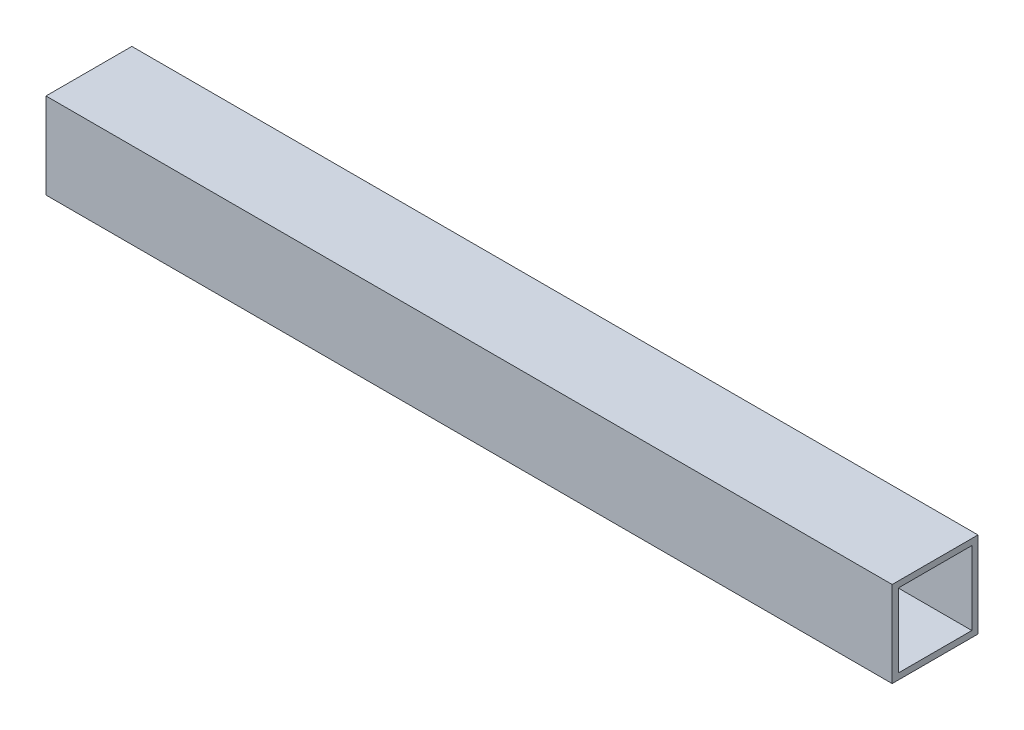
ISO-10303-21;
HEADER;
FILE_DESCRIPTION(('STEP AP214'),'2;1');
FILE_NAME('part.step','',(''),(''),'','','');
FILE_SCHEMA(('AUTOMOTIVE_DESIGN { 1 0 10303 214 1 1 1 1 }'));
ENDSEC;
DATA;
#1=APPLICATION_CONTEXT('core data for automotive mechanical design processes');
#2=APPLICATION_PROTOCOL_DEFINITION('international standard','automotive_design',2000,#1);
#3=PRODUCT_CONTEXT('',#1,'mechanical');
#4=PRODUCT('Part','Part','',(#3));
#5=PRODUCT_RELATED_PRODUCT_CATEGORY('part','',(#4));
#6=PRODUCT_DEFINITION_FORMATION('','',#4);
#7=PRODUCT_DEFINITION_CONTEXT('part definition',#1,'design');
#8=PRODUCT_DEFINITION('design','',#6,#7);
#9=PRODUCT_DEFINITION_SHAPE('','',#8);
#10=(LENGTH_UNIT() NAMED_UNIT(*) SI_UNIT(.MILLI.,.METRE.));
#11=(NAMED_UNIT(*) PLANE_ANGLE_UNIT() SI_UNIT($,.RADIAN.));
#12=(NAMED_UNIT(*) SI_UNIT($,.STERADIAN.) SOLID_ANGLE_UNIT());
#13=UNCERTAINTY_MEASURE_WITH_UNIT(LENGTH_MEASURE(1.E-05),#10,'distance_accuracy_value','');
#14=(GEOMETRIC_REPRESENTATION_CONTEXT(3) GLOBAL_UNCERTAINTY_ASSIGNED_CONTEXT((#13)) GLOBAL_UNIT_ASSIGNED_CONTEXT((#10,
#11,#12)) REPRESENTATION_CONTEXT('',''));
#15=CARTESIAN_POINT('',(0.,0.,0.));
#16=DIRECTION('',(0.,0.,1.));
#17=DIRECTION('',(1.,0.,0.));
#18=AXIS2_PLACEMENT_3D('',#15,#16,#17);
#19=CARTESIAN_POINT('',(438.15,0.,0.));
#20=DIRECTION('',(-1.,0.,0.));
#21=DIRECTION('',(0.,0.,1.));
#22=AXIS2_PLACEMENT_3D('',#19,#20,#21);
#23=PLANE('',#22);
#24=DIRECTION('',(0.,-1.,0.));
#25=VECTOR('',#24,1.);
#26=CARTESIAN_POINT('',(438.15,0.,0.));
#27=LINE('',#26,#25);
#28=CARTESIAN_POINT('',(438.15,44.45,0.));
#29=VERTEX_POINT('',#28);
#30=CARTESIAN_POINT('',(438.15,0.,0.));
#31=VERTEX_POINT('',#30);
#32=EDGE_CURVE('E138',#29,#31,#27,.T.);
#33=ORIENTED_EDGE('',*,*,#32,.T.);
#34=DIRECTION('',(0.,0.,-1.));
#35=VECTOR('',#34,1.);
#36=CARTESIAN_POINT('',(438.15,0.,0.));
#37=LINE('',#36,#35);
#38=CARTESIAN_POINT('',(438.15,0.,-44.45));
#39=VERTEX_POINT('',#38);
#40=EDGE_CURVE('E141',#31,#39,#37,.T.);
#41=ORIENTED_EDGE('',*,*,#40,.T.);
#42=DIRECTION('',(0.,1.,0.));
#43=VECTOR('',#42,1.);
#44=CARTESIAN_POINT('',(438.15,0.,-44.45));
#45=LINE('',#44,#43);
#46=CARTESIAN_POINT('',(438.15,44.45,-44.45));
#47=VERTEX_POINT('',#46);
#48=EDGE_CURVE('E144',#39,#47,#45,.T.);
#49=ORIENTED_EDGE('',*,*,#48,.T.);
#50=DIRECTION('',(0.,0.,1.));
#51=VECTOR('',#50,1.);
#52=CARTESIAN_POINT('',(438.15,44.45,0.));
#53=LINE('',#52,#51);
#54=EDGE_CURVE('E146',#47,#29,#53,.T.);
#55=ORIENTED_EDGE('',*,*,#54,.T.);
#56=EDGE_LOOP('',(#33,#41,#49,#55));
#57=FACE_BOUND('',#56,.T.);
#58=DIRECTION('',(0.,-1.,0.));
#59=VECTOR('',#58,1.);
#60=CARTESIAN_POINT('',(438.15,41.275,-3.175));
#61=LINE('',#60,#59);
#62=CARTESIAN_POINT('',(438.15,41.275,-3.175));
#63=VERTEX_POINT('',#62);
#64=CARTESIAN_POINT('',(438.15,3.175,-3.175));
#65=VERTEX_POINT('',#64);
#66=EDGE_CURVE('E102',#63,#65,#61,.T.);
#67=ORIENTED_EDGE('',*,*,#66,.F.);
#68=DIRECTION('',(0.,0.,1.));
#69=VECTOR('',#68,1.);
#70=CARTESIAN_POINT('',(438.15,41.275,-3.175));
#71=LINE('',#70,#69);
#72=CARTESIAN_POINT('',(438.15,41.275,-41.275));
#73=VERTEX_POINT('',#72);
#74=EDGE_CURVE('E124',#73,#63,#71,.T.);
#75=ORIENTED_EDGE('',*,*,#74,.F.);
#76=DIRECTION('',(0.,1.,0.));
#77=VECTOR('',#76,1.);
#78=CARTESIAN_POINT('',(438.15,41.275,-41.275));
#79=LINE('',#78,#77);
#80=CARTESIAN_POINT('',(438.15,3.175,-41.275));
#81=VERTEX_POINT('',#80);
#82=EDGE_CURVE('E122',#81,#73,#79,.T.);
#83=ORIENTED_EDGE('',*,*,#82,.F.);
#84=DIRECTION('',(0.,0.,-1.));
#85=VECTOR('',#84,1.);
#86=CARTESIAN_POINT('',(438.15,3.175,-3.175));
#87=LINE('',#86,#85);
#88=EDGE_CURVE('E110',#65,#81,#87,.T.);
#89=ORIENTED_EDGE('',*,*,#88,.F.);
#90=EDGE_LOOP('',(#67,#75,#83,#89));
#91=FACE_BOUND('',#90,.T.);
#92=ADVANCED_FACE('F37',(#57,#91),#23,.F.);
#93=CARTESIAN_POINT('',(0.,0.,0.));
#94=DIRECTION('',(-1.,0.,0.));
#95=DIRECTION('',(0.,0.,1.));
#96=AXIS2_PLACEMENT_3D('',#93,#94,#95);
#97=PLANE('',#96);
#98=DIRECTION('',(0.,-1.,0.));
#99=VECTOR('',#98,1.);
#100=CARTESIAN_POINT('',(0.,0.,0.));
#101=LINE('',#100,#99);
#102=CARTESIAN_POINT('',(0.,44.45,0.));
#103=VERTEX_POINT('',#102);
#104=CARTESIAN_POINT('',(0.,0.,0.));
#105=VERTEX_POINT('',#104);
#106=EDGE_CURVE('E118',#103,#105,#101,.T.);
#107=ORIENTED_EDGE('',*,*,#106,.F.);
#108=DIRECTION('',(0.,0.,1.));
#109=VECTOR('',#108,1.);
#110=CARTESIAN_POINT('',(0.,44.45,0.));
#111=LINE('',#110,#109);
#112=CARTESIAN_POINT('',(0.,44.45,-44.45));
#113=VERTEX_POINT('',#112);
#114=EDGE_CURVE('E142',#113,#103,#111,.T.);
#115=ORIENTED_EDGE('',*,*,#114,.F.);
#116=DIRECTION('',(0.,1.,0.));
#117=VECTOR('',#116,1.);
#118=CARTESIAN_POINT('',(0.,0.,-44.45));
#119=LINE('',#118,#117);
#120=CARTESIAN_POINT('',(0.,0.,-44.45));
#121=VERTEX_POINT('',#120);
#122=EDGE_CURVE('E153',#121,#113,#119,.T.);
#123=ORIENTED_EDGE('',*,*,#122,.F.);
#124=DIRECTION('',(0.,0.,-1.));
#125=VECTOR('',#124,1.);
#126=CARTESIAN_POINT('',(0.,0.,0.));
#127=LINE('',#126,#125);
#128=EDGE_CURVE('E151',#105,#121,#127,.T.);
#129=ORIENTED_EDGE('',*,*,#128,.F.);
#130=EDGE_LOOP('',(#107,#115,#123,#129));
#131=FACE_BOUND('',#130,.T.);
#132=DIRECTION('',(0.,0.,1.));
#133=VECTOR('',#132,1.);
#134=CARTESIAN_POINT('',(0.,41.275,-3.175));
#135=LINE('',#134,#133);
#136=CARTESIAN_POINT('',(0.,41.275,-41.275));
#137=VERTEX_POINT('',#136);
#138=CARTESIAN_POINT('',(0.,41.275,-3.175));
#139=VERTEX_POINT('',#138);
#140=EDGE_CURVE('E111',#137,#139,#135,.T.);
#141=ORIENTED_EDGE('',*,*,#140,.T.);
#142=DIRECTION('',(0.,-1.,0.));
#143=VECTOR('',#142,1.);
#144=CARTESIAN_POINT('',(0.,41.275,-3.175));
#145=LINE('',#144,#143);
#146=CARTESIAN_POINT('',(0.,3.175,-3.175));
#147=VERTEX_POINT('',#146);
#148=EDGE_CURVE('E60',#139,#147,#145,.T.);
#149=ORIENTED_EDGE('',*,*,#148,.T.);
#150=DIRECTION('',(0.,0.,-1.));
#151=VECTOR('',#150,1.);
#152=CARTESIAN_POINT('',(0.,3.175,-3.175));
#153=LINE('',#152,#151);
#154=CARTESIAN_POINT('',(0.,3.175,-41.275));
#155=VERTEX_POINT('',#154);
#156=EDGE_CURVE('E117',#147,#155,#153,.T.);
#157=ORIENTED_EDGE('',*,*,#156,.T.);
#158=DIRECTION('',(0.,1.,0.));
#159=VECTOR('',#158,1.);
#160=CARTESIAN_POINT('',(0.,41.275,-41.275));
#161=LINE('',#160,#159);
#162=EDGE_CURVE('E130',#155,#137,#161,.T.);
#163=ORIENTED_EDGE('',*,*,#162,.T.);
#164=EDGE_LOOP('',(#141,#149,#157,#163));
#165=FACE_BOUND('',#164,.T.);
#166=ADVANCED_FACE('F171',(#131,#165),#97,.T.);
#167=CARTESIAN_POINT('',(438.15,0.,0.));
#168=DIRECTION('',(0.,0.,-1.));
#169=DIRECTION('',(-1.,0.,0.));
#170=AXIS2_PLACEMENT_3D('',#167,#168,#169);
#171=PLANE('',#170);
#172=ORIENTED_EDGE('',*,*,#106,.T.);
#173=DIRECTION('',(-1.,0.,0.));
#174=VECTOR('',#173,1.);
#175=CARTESIAN_POINT('',(438.15,0.,0.));
#176=LINE('',#175,#174);
#177=EDGE_CURVE('E11',#31,#105,#176,.T.);
#178=ORIENTED_EDGE('',*,*,#177,.F.);
#179=ORIENTED_EDGE('',*,*,#32,.F.);
#180=DIRECTION('',(-1.,0.,0.));
#181=VECTOR('',#180,1.);
#182=CARTESIAN_POINT('',(438.15,44.45,0.));
#183=LINE('',#182,#181);
#184=EDGE_CURVE('E148',#29,#103,#183,.T.);
#185=ORIENTED_EDGE('',*,*,#184,.T.);
#186=EDGE_LOOP('',(#172,#178,#179,#185));
#187=FACE_BOUND('',#186,.T.);
#188=ADVANCED_FACE('F39',(#187),#171,.F.);
#189=CARTESIAN_POINT('',(438.15,0.,0.));
#190=DIRECTION('',(0.,1.,0.));
#191=DIRECTION('',(0.,0.,1.));
#192=AXIS2_PLACEMENT_3D('',#189,#190,#191);
#193=PLANE('',#192);
#194=ORIENTED_EDGE('',*,*,#128,.T.);
#195=DIRECTION('',(-1.,0.,0.));
#196=VECTOR('',#195,1.);
#197=CARTESIAN_POINT('',(438.15,0.,-44.45));
#198=LINE('',#197,#196);
#199=EDGE_CURVE('E45',#39,#121,#198,.T.);
#200=ORIENTED_EDGE('',*,*,#199,.F.);
#201=ORIENTED_EDGE('',*,*,#40,.F.);
#202=ORIENTED_EDGE('',*,*,#177,.T.);
#203=EDGE_LOOP('',(#194,#200,#201,#202));
#204=FACE_BOUND('',#203,.T.);
#205=ADVANCED_FACE('F181',(#204),#193,.F.);
#206=CARTESIAN_POINT('',(438.15,0.,-44.45));
#207=DIRECTION('',(0.,0.,1.));
#208=DIRECTION('',(1.,0.,0.));
#209=AXIS2_PLACEMENT_3D('',#206,#207,#208);
#210=PLANE('',#209);
#211=ORIENTED_EDGE('',*,*,#122,.T.);
#212=DIRECTION('',(-1.,0.,0.));
#213=VECTOR('',#212,1.);
#214=CARTESIAN_POINT('',(438.15,44.45,-44.45));
#215=LINE('',#214,#213);
#216=EDGE_CURVE('E158',#47,#113,#215,.T.);
#217=ORIENTED_EDGE('',*,*,#216,.F.);
#218=ORIENTED_EDGE('',*,*,#48,.F.);
#219=ORIENTED_EDGE('',*,*,#199,.T.);
#220=EDGE_LOOP('',(#211,#217,#218,#219));
#221=FACE_BOUND('',#220,.T.);
#222=ADVANCED_FACE('F165',(#221),#210,.F.);
#223=CARTESIAN_POINT('',(438.15,44.45,0.));
#224=DIRECTION('',(0.,-1.,0.));
#225=DIRECTION('',(0.,0.,-1.));
#226=AXIS2_PLACEMENT_3D('',#223,#224,#225);
#227=PLANE('',#226);
#228=ORIENTED_EDGE('',*,*,#114,.T.);
#229=ORIENTED_EDGE('',*,*,#184,.F.);
#230=ORIENTED_EDGE('',*,*,#54,.F.);
#231=ORIENTED_EDGE('',*,*,#216,.T.);
#232=EDGE_LOOP('',(#228,#229,#230,#231));
#233=FACE_BOUND('',#232,.T.);
#234=ADVANCED_FACE('F175',(#233),#227,.F.);
#235=CARTESIAN_POINT('',(438.15,41.275,-3.175));
#236=DIRECTION('',(0.,0.,-1.));
#237=DIRECTION('',(0.,1.,0.));
#238=AXIS2_PLACEMENT_3D('',#235,#236,#237);
#239=PLANE('',#238);
#240=ORIENTED_EDGE('',*,*,#148,.F.);
#241=DIRECTION('',(-1.,0.,0.));
#242=VECTOR('',#241,1.);
#243=CARTESIAN_POINT('',(438.15,41.275,-3.175));
#244=LINE('',#243,#242);
#245=EDGE_CURVE('E106',#63,#139,#244,.T.);
#246=ORIENTED_EDGE('',*,*,#245,.F.);
#247=ORIENTED_EDGE('',*,*,#66,.T.);
#248=DIRECTION('',(-1.,0.,0.));
#249=VECTOR('',#248,1.);
#250=CARTESIAN_POINT('',(438.15,3.175,-3.175));
#251=LINE('',#250,#249);
#252=EDGE_CURVE('E105',#65,#147,#251,.T.);
#253=ORIENTED_EDGE('',*,*,#252,.T.);
#254=EDGE_LOOP('',(#240,#246,#247,#253));
#255=FACE_BOUND('',#254,.T.);
#256=ADVANCED_FACE('F104',(#255),#239,.T.);
#257=CARTESIAN_POINT('',(438.15,3.175,-3.175));
#258=DIRECTION('',(0.,1.,0.));
#259=DIRECTION('',(0.,0.,1.));
#260=AXIS2_PLACEMENT_3D('',#257,#258,#259);
#261=PLANE('',#260);
#262=ORIENTED_EDGE('',*,*,#156,.F.);
#263=ORIENTED_EDGE('',*,*,#252,.F.);
#264=ORIENTED_EDGE('',*,*,#88,.T.);
#265=DIRECTION('',(-1.,0.,0.));
#266=VECTOR('',#265,1.);
#267=CARTESIAN_POINT('',(438.15,3.175,-41.275));
#268=LINE('',#267,#266);
#269=EDGE_CURVE('E119',#81,#155,#268,.T.);
#270=ORIENTED_EDGE('',*,*,#269,.T.);
#271=EDGE_LOOP('',(#262,#263,#264,#270));
#272=FACE_BOUND('',#271,.T.);
#273=ADVANCED_FACE('F114',(#272),#261,.T.);
#274=CARTESIAN_POINT('',(438.15,41.275,-41.275));
#275=DIRECTION('',(0.,0.,1.));
#276=DIRECTION('',(0.,-1.,0.));
#277=AXIS2_PLACEMENT_3D('',#274,#275,#276);
#278=PLANE('',#277);
#279=ORIENTED_EDGE('',*,*,#162,.F.);
#280=ORIENTED_EDGE('',*,*,#269,.F.);
#281=ORIENTED_EDGE('',*,*,#82,.T.);
#282=DIRECTION('',(-1.,0.,0.));
#283=VECTOR('',#282,1.);
#284=CARTESIAN_POINT('',(438.15,41.275,-41.275));
#285=LINE('',#284,#283);
#286=EDGE_CURVE('E52',#73,#137,#285,.T.);
#287=ORIENTED_EDGE('',*,*,#286,.T.);
#288=EDGE_LOOP('',(#279,#280,#281,#287));
#289=FACE_BOUND('',#288,.T.);
#290=ADVANCED_FACE('F204',(#289),#278,.T.);
#291=CARTESIAN_POINT('',(438.15,41.275,-3.175));
#292=DIRECTION('',(0.,-1.,0.));
#293=DIRECTION('',(0.,0.,-1.));
#294=AXIS2_PLACEMENT_3D('',#291,#292,#293);
#295=PLANE('',#294);
#296=ORIENTED_EDGE('',*,*,#140,.F.);
#297=ORIENTED_EDGE('',*,*,#286,.F.);
#298=ORIENTED_EDGE('',*,*,#74,.T.);
#299=ORIENTED_EDGE('',*,*,#245,.T.);
#300=EDGE_LOOP('',(#296,#297,#298,#299));
#301=FACE_BOUND('',#300,.T.);
#302=ADVANCED_FACE('F208',(#301),#295,.T.);
#303=CLOSED_SHELL('',(#92,#166,#188,#205,#222,#234,#256,#273,#290,#302));
#304=MANIFOLD_SOLID_BREP('B2',#303);
#305=ADVANCED_BREP_SHAPE_REPRESENTATION('',(#18,#304),#14);
#306=SHAPE_DEFINITION_REPRESENTATION(#9,#305);
ENDSEC;
END-ISO-10303-21;
